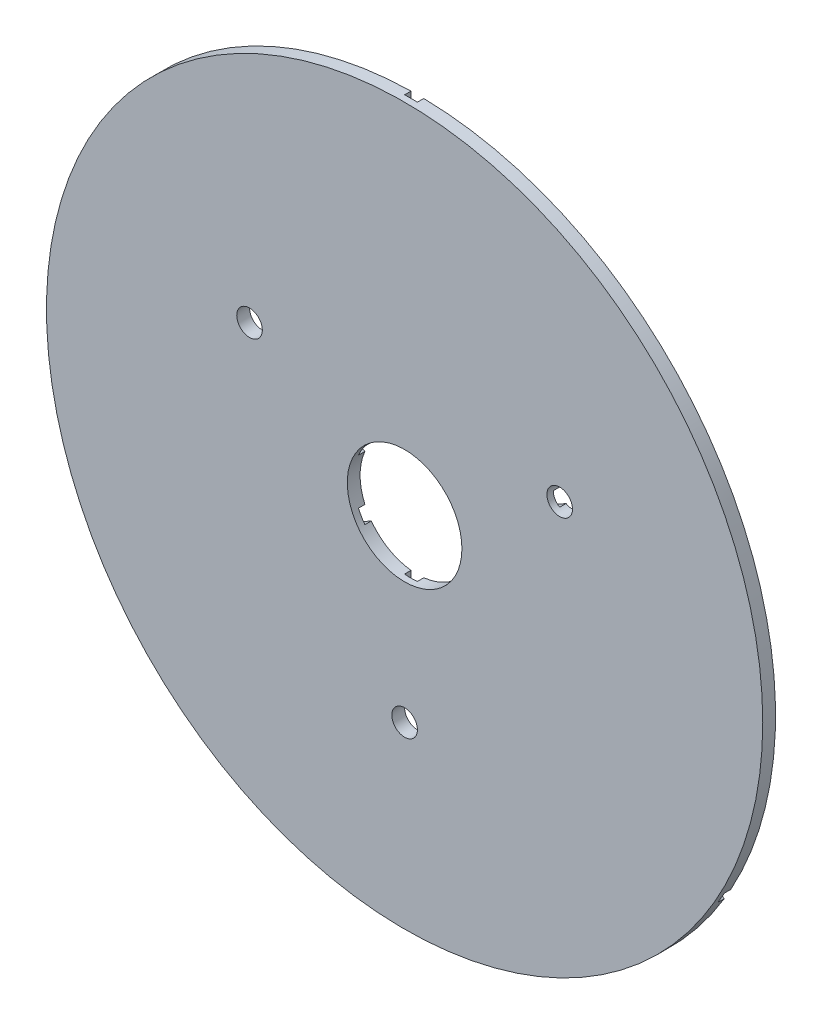
ISO-10303-21;
HEADER;
FILE_DESCRIPTION(('STEP AP214'),'2;1');
FILE_NAME('part.step','',(''),(''),'','','');
FILE_SCHEMA(('AUTOMOTIVE_DESIGN { 1 0 10303 214 1 1 1 1 }'));
ENDSEC;
DATA;
#1=APPLICATION_CONTEXT('core data for automotive mechanical design processes');
#2=APPLICATION_PROTOCOL_DEFINITION('international standard','automotive_design',2000,#1);
#3=PRODUCT_CONTEXT('',#1,'mechanical');
#4=PRODUCT('Part','Part','',(#3));
#5=PRODUCT_RELATED_PRODUCT_CATEGORY('part','',(#4));
#6=PRODUCT_DEFINITION_FORMATION('','',#4);
#7=PRODUCT_DEFINITION_CONTEXT('part definition',#1,'design');
#8=PRODUCT_DEFINITION('design','',#6,#7);
#9=PRODUCT_DEFINITION_SHAPE('','',#8);
#10=(LENGTH_UNIT() NAMED_UNIT(*) SI_UNIT(.MILLI.,.METRE.));
#11=(NAMED_UNIT(*) PLANE_ANGLE_UNIT() SI_UNIT($,.RADIAN.));
#12=(NAMED_UNIT(*) SI_UNIT($,.STERADIAN.) SOLID_ANGLE_UNIT());
#13=UNCERTAINTY_MEASURE_WITH_UNIT(LENGTH_MEASURE(1.E-05),#10,'distance_accuracy_value','');
#14=(GEOMETRIC_REPRESENTATION_CONTEXT(3) GLOBAL_UNCERTAINTY_ASSIGNED_CONTEXT((#13)) GLOBAL_UNIT_ASSIGNED_CONTEXT((#10,
#11,#12)) REPRESENTATION_CONTEXT('',''));
#15=CARTESIAN_POINT('',(0.,0.,0.));
#16=DIRECTION('',(0.,0.,1.));
#17=DIRECTION('',(1.,0.,0.));
#18=AXIS2_PLACEMENT_3D('',#15,#16,#17);
#19=CARTESIAN_POINT('',(0.,0.,1.5875));
#20=DIRECTION('',(0.,0.,-1.));
#21=DIRECTION('',(-1.,0.,0.));
#22=AXIS2_PLACEMENT_3D('',#19,#20,#21);
#23=PLANE('',#22);
#24=CARTESIAN_POINT('',(0.,0.,1.5875));
#25=DIRECTION('',(0.,0.,-1.));
#26=DIRECTION('',(-1.,0.,0.));
#27=AXIS2_PLACEMENT_3D('',#24,#25,#26);
#28=CIRCLE('',#27,14.224);
#29=CARTESIAN_POINT('',(-13.0351353306108,5.692751787375,1.5875));
#30=VERTEX_POINT('',#29);
#31=CARTESIAN_POINT('',(-11.4476353306107,8.44238244439053,1.5875));
#32=VERTEX_POINT('',#31);
#33=EDGE_CURVE('E11',#30,#32,#28,.T.);
#34=ORIENTED_EDGE('',*,*,#33,.F.);
#35=DIRECTION('',(-0.866025403784436,0.500000000000005,0.));
#36=VECTOR('',#35,1.);
#37=CARTESIAN_POINT('',(-0.793749999999747,-1.37481532850734,1.5875));
#38=LINE('',#37,#36);
#39=CARTESIAN_POINT('',(-36.9073291982175,19.4753693429848,1.5875));
#40=VERTEX_POINT('',#39);
#41=EDGE_CURVE('E139',#30,#40,#38,.T.);
#42=ORIENTED_EDGE('',*,*,#41,.T.);
#43=CARTESIAN_POINT('',(-38.4948291982183,22.225,1.5875));
#44=DIRECTION('',(0.,0.,-1.));
#45=DIRECTION('',(-1.,0.,0.));
#46=AXIS2_PLACEMENT_3D('',#43,#44,#45);
#47=CIRCLE('',#46,3.175);
#48=CARTESIAN_POINT('',(-35.3198291982183,22.2250000000009,1.5875));
#49=VERTEX_POINT('',#48);
#50=EDGE_CURVE('E57',#49,#40,#47,.T.);
#51=ORIENTED_EDGE('',*,*,#50,.F.);
#52=DIRECTION('',(-0.866025403784436,0.500000000000005,0.));
#53=VECTOR('',#52,1.);
#54=CARTESIAN_POINT('',(0.793750000000271,1.37481532850825,1.5875));
#55=LINE('',#54,#53);
#56=EDGE_CURVE('E178',#32,#49,#55,.T.);
#57=ORIENTED_EDGE('',*,*,#56,.F.);
#58=EDGE_LOOP('',(#34,#42,#51,#57));
#59=FACE_BOUND('',#58,.T.);
#60=ADVANCED_FACE('F32',(#59),#23,.T.);
#61=CARTESIAN_POINT('',(-1.5875,14.1351342317645,1.5875));
#62=VERTEX_POINT('',#61);
#63=CARTESIAN_POINT('',(1.5875,14.1351342317645,1.5875));
#64=VERTEX_POINT('',#63);
#65=EDGE_CURVE('E41',#62,#64,#28,.T.);
#66=ORIENTED_EDGE('',*,*,#65,.F.);
#67=DIRECTION('',(0.,1.,0.));
#68=VECTOR('',#67,1.);
#69=CARTESIAN_POINT('',(-1.5875,0.,1.5875));
#70=LINE('',#69,#68);
#71=CARTESIAN_POINT('',(-1.5875,88.8858247627258,1.5875));
#72=VERTEX_POINT('',#71);
#73=EDGE_CURVE('E94',#62,#72,#70,.T.);
#74=ORIENTED_EDGE('',*,*,#73,.T.);
#75=CARTESIAN_POINT('',(0.,0.,1.5875));
#76=DIRECTION('',(0.,0.,-1.));
#77=DIRECTION('',(-1.,0.,0.));
#78=AXIS2_PLACEMENT_3D('',#75,#76,#77);
#79=CIRCLE('',#78,88.9);
#80=CARTESIAN_POINT('',(1.5875,88.8858247627258,1.5875));
#81=VERTEX_POINT('',#80);
#82=EDGE_CURVE('E294',#72,#81,#79,.T.);
#83=ORIENTED_EDGE('',*,*,#82,.T.);
#84=DIRECTION('',(0.,1.,0.));
#85=VECTOR('',#84,1.);
#86=CARTESIAN_POINT('',(1.5875,0.,1.5875));
#87=LINE('',#86,#85);
#88=EDGE_CURVE('E299',#64,#81,#87,.T.);
#89=ORIENTED_EDGE('',*,*,#88,.F.);
#90=EDGE_LOOP('',(#66,#74,#83,#89));
#91=FACE_BOUND('',#90,.T.);
#92=ADVANCED_FACE('F447',(#91),#23,.T.);
#93=CARTESIAN_POINT('',(11.4476353306107,8.44238244439054,1.5875));
#94=VERTEX_POINT('',#93);
#95=CARTESIAN_POINT('',(13.0351353306108,5.69275178737501,1.5875));
#96=VERTEX_POINT('',#95);
#97=EDGE_CURVE('E477',#94,#96,#28,.T.);
#98=ORIENTED_EDGE('',*,*,#97,.F.);
#99=DIRECTION('',(0.866025403784436,0.500000000000005,0.));
#100=VECTOR('',#99,1.);
#101=CARTESIAN_POINT('',(-0.793750000000274,1.37481532850825,1.5875));
#102=LINE('',#101,#100);
#103=CARTESIAN_POINT('',(35.3198291982183,22.2250000000009,1.5875));
#104=VERTEX_POINT('',#103);
#105=EDGE_CURVE('E301',#94,#104,#102,.T.);
#106=ORIENTED_EDGE('',*,*,#105,.T.);
#107=CARTESIAN_POINT('',(38.4948291982183,22.225,1.5875));
#108=DIRECTION('',(0.,0.,-1.));
#109=DIRECTION('',(-1.,0.,0.));
#110=AXIS2_PLACEMENT_3D('',#107,#108,#109);
#111=CIRCLE('',#110,3.175);
#112=CARTESIAN_POINT('',(36.9073291982175,19.4753693429848,1.5875));
#113=VERTEX_POINT('',#112);
#114=EDGE_CURVE('E304',#113,#104,#111,.T.);
#115=ORIENTED_EDGE('',*,*,#114,.F.);
#116=DIRECTION('',(0.866025403784436,0.500000000000005,0.));
#117=VECTOR('',#116,1.);
#118=CARTESIAN_POINT('',(0.793749999999744,-1.37481532850733,1.5875));
#119=LINE('',#118,#117);
#120=EDGE_CURVE('E306',#96,#113,#119,.T.);
#121=ORIENTED_EDGE('',*,*,#120,.F.);
#122=EDGE_LOOP('',(#98,#106,#115,#121));
#123=FACE_BOUND('',#122,.T.);
#124=ADVANCED_FACE('F452',(#123),#23,.T.);
#125=CARTESIAN_POINT('',(13.0351353306113,-5.69275178737403,1.5875));
#126=VERTEX_POINT('',#125);
#127=CARTESIAN_POINT('',(11.4476353306113,-8.44238244438968,1.5875));
#128=VERTEX_POINT('',#127);
#129=EDGE_CURVE('E475',#126,#128,#28,.T.);
#130=ORIENTED_EDGE('',*,*,#129,.F.);
#131=DIRECTION('',(-0.866025403784436,0.500000000000005,0.));
#132=VECTOR('',#131,1.);
#133=CARTESIAN_POINT('',(0.793750000000271,1.37481532850825,1.5875));
#134=LINE('',#133,#132);
#135=CARTESIAN_POINT('',(77.7711322808525,-43.0680970528551,1.5875));
#136=VERTEX_POINT('',#135);
#137=EDGE_CURVE('E309',#136,#126,#134,.T.);
#138=ORIENTED_EDGE('',*,*,#137,.F.);
#139=CARTESIAN_POINT('',(0.,0.,1.5875));
#140=DIRECTION('',(0.,0.,-1.));
#141=DIRECTION('',(-1.,0.,0.));
#142=AXIS2_PLACEMENT_3D('',#139,#140,#141);
#143=CIRCLE('',#142,88.9);
#144=CARTESIAN_POINT('',(76.1836322808525,-45.8177277098707,1.5875));
#145=VERTEX_POINT('',#144);
#146=EDGE_CURVE('E312',#136,#145,#143,.T.);
#147=ORIENTED_EDGE('',*,*,#146,.T.);
#148=DIRECTION('',(-0.866025403784436,0.500000000000005,0.));
#149=VECTOR('',#148,1.);
#150=CARTESIAN_POINT('',(-0.793749999999747,-1.37481532850734,1.5875));
#151=LINE('',#150,#149);
#152=EDGE_CURVE('E315',#145,#128,#151,.T.);
#153=ORIENTED_EDGE('',*,*,#152,.T.);
#154=EDGE_LOOP('',(#130,#138,#147,#153));
#155=FACE_BOUND('',#154,.T.);
#156=ADVANCED_FACE('F461',(#155),#23,.T.);
#157=CARTESIAN_POINT('',(1.5875,-14.1351342317645,1.5875));
#158=VERTEX_POINT('',#157);
#159=CARTESIAN_POINT('',(-1.5875,-14.1351342317645,1.5875));
#160=VERTEX_POINT('',#159);
#161=EDGE_CURVE('E329',#158,#160,#28,.T.);
#162=ORIENTED_EDGE('',*,*,#161,.F.);
#163=DIRECTION('',(0.,1.,0.));
#164=VECTOR('',#163,1.);
#165=CARTESIAN_POINT('',(1.5875,0.,1.5875));
#166=LINE('',#165,#164);
#167=CARTESIAN_POINT('',(1.5875,-41.7003693429844,1.5875));
#168=VERTEX_POINT('',#167);
#169=EDGE_CURVE('E318',#168,#158,#166,.T.);
#170=ORIENTED_EDGE('',*,*,#169,.F.);
#171=CARTESIAN_POINT('',(0.,-44.45,1.5875));
#172=DIRECTION('',(0.,0.,-1.));
#173=DIRECTION('',(-1.,0.,0.));
#174=AXIS2_PLACEMENT_3D('',#171,#172,#173);
#175=CIRCLE('',#174,3.175);
#176=CARTESIAN_POINT('',(-1.5875,-41.7003693429844,1.5875));
#177=VERTEX_POINT('',#176);
#178=EDGE_CURVE('E321',#177,#168,#175,.T.);
#179=ORIENTED_EDGE('',*,*,#178,.F.);
#180=DIRECTION('',(0.,1.,0.));
#181=VECTOR('',#180,1.);
#182=CARTESIAN_POINT('',(-1.5875,0.,1.5875));
#183=LINE('',#182,#181);
#184=EDGE_CURVE('E133',#177,#160,#183,.T.);
#185=ORIENTED_EDGE('',*,*,#184,.T.);
#186=EDGE_LOOP('',(#162,#170,#179,#185));
#187=FACE_BOUND('',#186,.T.);
#188=ADVANCED_FACE('F327',(#187),#23,.T.);
#189=CARTESIAN_POINT('',(0.,0.,3.175));
#190=DIRECTION('',(0.,0.,-1.));
#191=DIRECTION('',(-1.,0.,0.));
#192=AXIS2_PLACEMENT_3D('',#189,#190,#191);
#193=CYLINDRICAL_SURFACE('',#192,88.9);
#194=CARTESIAN_POINT('',(0.,0.,3.175));
#195=DIRECTION('',(0.,0.,1.));
#196=DIRECTION('',(1.,0.,0.));
#197=AXIS2_PLACEMENT_3D('',#194,#195,#196);
#198=CIRCLE('',#197,88.9);
#199=CARTESIAN_POINT('',(88.9,0.,3.175));
#200=VERTEX_POINT('',#199);
#201=EDGE_CURVE('E207',#200,#200,#198,.T.);
#202=ORIENTED_EDGE('',*,*,#201,.F.);
#203=EDGE_LOOP('',(#202));
#204=FACE_BOUND('',#203,.T.);
#205=DIRECTION('',(0.,0.,-1.));
#206=VECTOR('',#205,1.);
#207=CARTESIAN_POINT('',(1.5875,88.8858247627258,1.5875));
#208=LINE('',#207,#206);
#209=CARTESIAN_POINT('',(1.5875,88.8858247627258,0.));
#210=VERTEX_POINT('',#209);
#211=EDGE_CURVE('E202',#81,#210,#208,.T.);
#212=ORIENTED_EDGE('',*,*,#211,.F.);
#213=ORIENTED_EDGE('',*,*,#82,.F.);
#214=DIRECTION('',(0.,0.,-1.));
#215=VECTOR('',#214,1.);
#216=CARTESIAN_POINT('',(-1.5875,88.8858247627258,1.5875));
#217=LINE('',#216,#215);
#218=CARTESIAN_POINT('',(-1.5875,88.8858247627258,0.));
#219=VERTEX_POINT('',#218);
#220=EDGE_CURVE('E145',#72,#219,#217,.T.);
#221=ORIENTED_EDGE('',*,*,#220,.T.);
#222=CARTESIAN_POINT('',(0.,0.,0.));
#223=DIRECTION('',(0.,0.,1.));
#224=DIRECTION('',(1.,0.,0.));
#225=AXIS2_PLACEMENT_3D('',#222,#223,#224);
#226=CIRCLE('',#225,88.9);
#227=CARTESIAN_POINT('',(-77.7711322808525,-43.0680970528551,0.));
#228=VERTEX_POINT('',#227);
#229=EDGE_CURVE('E209',#219,#228,#226,.T.);
#230=ORIENTED_EDGE('',*,*,#229,.T.);
#231=DIRECTION('',(0.,0.,-1.));
#232=VECTOR('',#231,1.);
#233=CARTESIAN_POINT('',(-77.7711322808525,-43.0680970528551,1.5875));
#234=LINE('',#233,#232);
#235=CARTESIAN_POINT('',(-77.7711322808525,-43.0680970528551,1.5875));
#236=VERTEX_POINT('',#235);
#237=EDGE_CURVE('E85',#236,#228,#234,.T.);
#238=ORIENTED_EDGE('',*,*,#237,.F.);
#239=CARTESIAN_POINT('',(0.,0.,1.5875));
#240=DIRECTION('',(0.,0.,-1.));
#241=DIRECTION('',(-1.,0.,0.));
#242=AXIS2_PLACEMENT_3D('',#239,#240,#241);
#243=CIRCLE('',#242,88.9);
#244=CARTESIAN_POINT('',(-76.1836322808525,-45.8177277098707,1.5875));
#245=VERTEX_POINT('',#244);
#246=EDGE_CURVE('E132',#245,#236,#243,.T.);
#247=ORIENTED_EDGE('',*,*,#246,.F.);
#248=DIRECTION('',(0.,0.,-1.));
#249=VECTOR('',#248,1.);
#250=CARTESIAN_POINT('',(-76.1836322808525,-45.8177277098707,1.5875));
#251=LINE('',#250,#249);
#252=CARTESIAN_POINT('',(-76.1836322808525,-45.8177277098707,0.));
#253=VERTEX_POINT('',#252);
#254=EDGE_CURVE('E116',#245,#253,#251,.T.);
#255=ORIENTED_EDGE('',*,*,#254,.T.);
#256=CARTESIAN_POINT('',(76.1836322808525,-45.8177277098707,0.));
#257=VERTEX_POINT('',#256);
#258=EDGE_CURVE('E211',#253,#257,#226,.T.);
#259=ORIENTED_EDGE('',*,*,#258,.T.);
#260=DIRECTION('',(0.,0.,-1.));
#261=VECTOR('',#260,1.);
#262=CARTESIAN_POINT('',(76.1836322808525,-45.8177277098707,1.5875));
#263=LINE('',#262,#261);
#264=EDGE_CURVE('E191',#145,#257,#263,.T.);
#265=ORIENTED_EDGE('',*,*,#264,.F.);
#266=ORIENTED_EDGE('',*,*,#146,.F.);
#267=DIRECTION('',(0.,0.,-1.));
#268=VECTOR('',#267,1.);
#269=CARTESIAN_POINT('',(77.7711322808525,-43.0680970528551,1.5875));
#270=LINE('',#269,#268);
#271=CARTESIAN_POINT('',(77.7711322808525,-43.0680970528551,0.));
#272=VERTEX_POINT('',#271);
#273=EDGE_CURVE('E193',#136,#272,#270,.T.);
#274=ORIENTED_EDGE('',*,*,#273,.T.);
#275=EDGE_CURVE('E182',#272,#210,#226,.T.);
#276=ORIENTED_EDGE('',*,*,#275,.T.);
#277=EDGE_LOOP('',(#212,#213,#221,#230,#238,#247,#255,#259,#265,#266,#274,#276));
#278=FACE_BOUND('',#277,.T.);
#279=ADVANCED_FACE('F34',(#204,#278),#193,.T.);
#280=CARTESIAN_POINT('',(0.,0.,0.));
#281=DIRECTION('',(0.,0.,1.));
#282=DIRECTION('',(1.,0.,0.));
#283=AXIS2_PLACEMENT_3D('',#280,#281,#282);
#284=PLANE('',#283);
#285=DIRECTION('',(0.,1.,0.));
#286=VECTOR('',#285,1.);
#287=CARTESIAN_POINT('',(-1.5875,0.,0.));
#288=LINE('',#287,#286);
#289=CARTESIAN_POINT('',(-1.5875,-41.7003693429844,0.));
#290=VERTEX_POINT('',#289);
#291=CARTESIAN_POINT('',(-1.5875,-14.1351342317645,0.));
#292=VERTEX_POINT('',#291);
#293=EDGE_CURVE('E169',#290,#292,#288,.T.);
#294=ORIENTED_EDGE('',*,*,#293,.F.);
#295=CARTESIAN_POINT('',(0.,-44.45,0.));
#296=DIRECTION('',(0.,0.,-1.));
#297=DIRECTION('',(-1.,0.,0.));
#298=AXIS2_PLACEMENT_3D('',#295,#296,#297);
#299=CIRCLE('',#298,3.175);
#300=CARTESIAN_POINT('',(1.5875,-41.7003693429844,0.));
#301=VERTEX_POINT('',#300);
#302=EDGE_CURVE('E386',#301,#290,#299,.T.);
#303=ORIENTED_EDGE('',*,*,#302,.F.);
#304=DIRECTION('',(0.,1.,0.));
#305=VECTOR('',#304,1.);
#306=CARTESIAN_POINT('',(1.5875,0.,0.));
#307=LINE('',#306,#305);
#308=CARTESIAN_POINT('',(1.5875,-14.1351342317645,0.));
#309=VERTEX_POINT('',#308);
#310=EDGE_CURVE('E166',#301,#309,#307,.T.);
#311=ORIENTED_EDGE('',*,*,#310,.T.);
#312=CARTESIAN_POINT('',(0.,0.,0.));
#313=DIRECTION('',(0.,0.,1.));
#314=DIRECTION('',(1.,0.,0.));
#315=AXIS2_PLACEMENT_3D('',#312,#313,#314);
#316=CIRCLE('',#315,14.224);
#317=CARTESIAN_POINT('',(11.4476353306113,-8.44238244438968,0.));
#318=VERTEX_POINT('',#317);
#319=EDGE_CURVE('E393',#309,#318,#316,.T.);
#320=ORIENTED_EDGE('',*,*,#319,.T.);
#321=DIRECTION('',(-0.866025403784436,0.500000000000005,0.));
#322=VECTOR('',#321,1.);
#323=CARTESIAN_POINT('',(-0.793749999999747,-1.37481532850734,0.));
#324=LINE('',#323,#322);
#325=EDGE_CURVE('E163',#257,#318,#324,.T.);
#326=ORIENTED_EDGE('',*,*,#325,.F.);
#327=ORIENTED_EDGE('',*,*,#258,.F.);
#328=DIRECTION('',(0.866025403784436,0.500000000000005,0.));
#329=VECTOR('',#328,1.);
#330=CARTESIAN_POINT('',(0.793749999999744,-1.37481532850733,0.));
#331=LINE('',#330,#329);
#332=CARTESIAN_POINT('',(-11.4476353306113,-8.44238244438967,0.));
#333=VERTEX_POINT('',#332);
#334=EDGE_CURVE('E121',#253,#333,#331,.T.);
#335=ORIENTED_EDGE('',*,*,#334,.T.);
#336=EDGE_CURVE('E503',#333,#292,#316,.T.);
#337=ORIENTED_EDGE('',*,*,#336,.T.);
#338=EDGE_LOOP('',(#294,#303,#311,#320,#326,#327,#335,#337));
#339=FACE_BOUND('',#338,.T.);
#340=ADVANCED_FACE('F466',(#339),#284,.F.);
#341=DIRECTION('',(0.866025403784436,0.500000000000005,0.));
#342=VECTOR('',#341,1.);
#343=CARTESIAN_POINT('',(0.793749999999744,-1.37481532850733,0.));
#344=LINE('',#343,#342);
#345=CARTESIAN_POINT('',(13.0351353306108,5.69275178737501,0.));
#346=VERTEX_POINT('',#345);
#347=CARTESIAN_POINT('',(36.9073291982175,19.4753693429848,0.));
#348=VERTEX_POINT('',#347);
#349=EDGE_CURVE('E157',#346,#348,#344,.T.);
#350=ORIENTED_EDGE('',*,*,#349,.T.);
#351=CARTESIAN_POINT('',(38.4948291982183,22.225,0.));
#352=DIRECTION('',(0.,0.,-1.));
#353=DIRECTION('',(-1.,0.,0.));
#354=AXIS2_PLACEMENT_3D('',#351,#352,#353);
#355=CIRCLE('',#354,3.175);
#356=CARTESIAN_POINT('',(35.3198291982183,22.225,0.));
#357=VERTEX_POINT('',#356);
#358=EDGE_CURVE('E383',#357,#348,#355,.T.);
#359=ORIENTED_EDGE('',*,*,#358,.F.);
#360=DIRECTION('',(0.866025403784436,0.500000000000005,0.));
#361=VECTOR('',#360,1.);
#362=CARTESIAN_POINT('',(-0.793750000000274,1.37481532850825,0.));
#363=LINE('',#362,#361);
#364=CARTESIAN_POINT('',(11.4476353306107,8.44238244439053,0.));
#365=VERTEX_POINT('',#364);
#366=EDGE_CURVE('E154',#365,#357,#363,.T.);
#367=ORIENTED_EDGE('',*,*,#366,.F.);
#368=CARTESIAN_POINT('',(1.5875,14.1351342317645,0.));
#369=VERTEX_POINT('',#368);
#370=EDGE_CURVE('E363',#365,#369,#316,.T.);
#371=ORIENTED_EDGE('',*,*,#370,.T.);
#372=DIRECTION('',(0.,1.,0.));
#373=VECTOR('',#372,1.);
#374=CARTESIAN_POINT('',(1.5875,0.,0.));
#375=LINE('',#374,#373);
#376=EDGE_CURVE('E152',#369,#210,#375,.T.);
#377=ORIENTED_EDGE('',*,*,#376,.T.);
#378=ORIENTED_EDGE('',*,*,#275,.F.);
#379=DIRECTION('',(-0.866025403784436,0.500000000000005,0.));
#380=VECTOR('',#379,1.);
#381=CARTESIAN_POINT('',(0.793750000000271,1.37481532850825,0.));
#382=LINE('',#381,#380);
#383=CARTESIAN_POINT('',(13.0351353306113,-5.69275178737403,0.));
#384=VERTEX_POINT('',#383);
#385=EDGE_CURVE('E160',#272,#384,#382,.T.);
#386=ORIENTED_EDGE('',*,*,#385,.T.);
#387=EDGE_CURVE('E390',#384,#346,#316,.T.);
#388=ORIENTED_EDGE('',*,*,#387,.T.);
#389=EDGE_LOOP('',(#350,#359,#367,#371,#377,#378,#386,#388));
#390=FACE_BOUND('',#389,.T.);
#391=ADVANCED_FACE('F418',(#390),#284,.F.);
#392=CARTESIAN_POINT('',(0.,0.,3.175));
#393=DIRECTION('',(0.,0.,1.));
#394=DIRECTION('',(1.,0.,0.));
#395=AXIS2_PLACEMENT_3D('',#392,#393,#394);
#396=PLANE('',#395);
#397=CARTESIAN_POINT('',(38.4948291982183,22.225,3.175));
#398=DIRECTION('',(0.,0.,-1.));
#399=DIRECTION('',(-1.,0.,0.));
#400=AXIS2_PLACEMENT_3D('',#397,#398,#399);
#401=CIRCLE('',#400,3.175);
#402=CARTESIAN_POINT('',(35.3198291982183,22.225,3.175));
#403=VERTEX_POINT('',#402);
#404=EDGE_CURVE('E397',#403,#403,#401,.T.);
#405=ORIENTED_EDGE('',*,*,#404,.T.);
#406=EDGE_LOOP('',(#405));
#407=FACE_BOUND('',#406,.T.);
#408=CARTESIAN_POINT('',(-38.4948291982183,22.225,3.175));
#409=DIRECTION('',(0.,0.,-1.));
#410=DIRECTION('',(-1.,0.,0.));
#411=AXIS2_PLACEMENT_3D('',#408,#409,#410);
#412=CIRCLE('',#411,3.175);
#413=CARTESIAN_POINT('',(-41.6698291982183,22.225,3.175));
#414=VERTEX_POINT('',#413);
#415=EDGE_CURVE('E379',#414,#414,#412,.T.);
#416=ORIENTED_EDGE('',*,*,#415,.T.);
#417=EDGE_LOOP('',(#416));
#418=FACE_BOUND('',#417,.T.);
#419=CARTESIAN_POINT('',(0.,-44.45,3.175));
#420=DIRECTION('',(0.,0.,-1.));
#421=DIRECTION('',(-1.,0.,0.));
#422=AXIS2_PLACEMENT_3D('',#419,#420,#421);
#423=CIRCLE('',#422,3.175);
#424=CARTESIAN_POINT('',(-3.175,-44.45,3.175));
#425=VERTEX_POINT('',#424);
#426=EDGE_CURVE('E380',#425,#425,#423,.T.);
#427=ORIENTED_EDGE('',*,*,#426,.T.);
#428=EDGE_LOOP('',(#427));
#429=FACE_BOUND('',#428,.T.);
#430=CARTESIAN_POINT('',(0.,0.,3.175));
#431=DIRECTION('',(0.,0.,1.));
#432=DIRECTION('',(1.,0.,0.));
#433=AXIS2_PLACEMENT_3D('',#430,#431,#432);
#434=CIRCLE('',#433,14.224);
#435=CARTESIAN_POINT('',(14.224,0.,3.175));
#436=VERTEX_POINT('',#435);
#437=EDGE_CURVE('E394',#436,#436,#434,.T.);
#438=ORIENTED_EDGE('',*,*,#437,.F.);
#439=EDGE_LOOP('',(#438));
#440=FACE_BOUND('',#439,.T.);
#441=ORIENTED_EDGE('',*,*,#201,.T.);
#442=EDGE_LOOP('',(#441));
#443=FACE_BOUND('',#442,.T.);
#444=ADVANCED_FACE('F430',(#407,#418,#429,#440,#443),#396,.T.);
#445=DIRECTION('',(-0.866025403784436,0.500000000000005,0.));
#446=VECTOR('',#445,1.);
#447=CARTESIAN_POINT('',(0.793750000000271,1.37481532850825,0.));
#448=LINE('',#447,#446);
#449=CARTESIAN_POINT('',(-11.4476353306107,8.44238244439053,0.));
#450=VERTEX_POINT('',#449);
#451=CARTESIAN_POINT('',(-35.3198291982183,22.2250000000009,0.));
#452=VERTEX_POINT('',#451);
#453=EDGE_CURVE('E146',#450,#452,#448,.T.);
#454=ORIENTED_EDGE('',*,*,#453,.T.);
#455=CARTESIAN_POINT('',(-38.4948291982183,22.225,0.));
#456=DIRECTION('',(0.,0.,-1.));
#457=DIRECTION('',(-1.,0.,0.));
#458=AXIS2_PLACEMENT_3D('',#455,#456,#457);
#459=CIRCLE('',#458,3.175);
#460=CARTESIAN_POINT('',(-36.9073291982175,19.4753693429848,0.));
#461=VERTEX_POINT('',#460);
#462=EDGE_CURVE('E378',#461,#452,#459,.T.);
#463=ORIENTED_EDGE('',*,*,#462,.F.);
#464=DIRECTION('',(-0.866025403784436,0.500000000000005,0.));
#465=VECTOR('',#464,1.);
#466=CARTESIAN_POINT('',(-0.793749999999747,-1.37481532850734,0.));
#467=LINE('',#466,#465);
#468=CARTESIAN_POINT('',(-13.0351353306108,5.692751787375,0.));
#469=VERTEX_POINT('',#468);
#470=EDGE_CURVE('E175',#469,#461,#467,.T.);
#471=ORIENTED_EDGE('',*,*,#470,.F.);
#472=CARTESIAN_POINT('',(-13.0351353306113,-5.69275178737403,0.));
#473=VERTEX_POINT('',#472);
#474=EDGE_CURVE('E224',#469,#473,#316,.T.);
#475=ORIENTED_EDGE('',*,*,#474,.T.);
#476=DIRECTION('',(0.866025403784436,0.500000000000005,0.));
#477=VECTOR('',#476,1.);
#478=CARTESIAN_POINT('',(-0.793750000000274,1.37481532850825,0.));
#479=LINE('',#478,#477);
#480=EDGE_CURVE('E173',#228,#473,#479,.T.);
#481=ORIENTED_EDGE('',*,*,#480,.F.);
#482=ORIENTED_EDGE('',*,*,#229,.F.);
#483=DIRECTION('',(0.,1.,0.));
#484=VECTOR('',#483,1.);
#485=CARTESIAN_POINT('',(-1.5875,0.,0.));
#486=LINE('',#485,#484);
#487=CARTESIAN_POINT('',(-1.5875,14.1351342317645,0.));
#488=VERTEX_POINT('',#487);
#489=EDGE_CURVE('E149',#488,#219,#486,.T.);
#490=ORIENTED_EDGE('',*,*,#489,.F.);
#491=EDGE_CURVE('E360',#488,#450,#316,.T.);
#492=ORIENTED_EDGE('',*,*,#491,.T.);
#493=EDGE_LOOP('',(#454,#463,#471,#475,#481,#482,#490,#492));
#494=FACE_BOUND('',#493,.T.);
#495=ADVANCED_FACE('F217',(#494),#284,.F.);
#496=CARTESIAN_POINT('',(0.793750000000271,1.37481532850825,1.5875));
#497=DIRECTION('',(-0.500000000000005,-0.866025403784436,0.));
#498=DIRECTION('',(0.866025403784436,-0.500000000000005,0.));
#499=AXIS2_PLACEMENT_3D('',#496,#497,#498);
#500=PLANE('',#499);
#501=DIRECTION('',(0.,0.,1.));
#502=VECTOR('',#501,1.);
#503=CARTESIAN_POINT('',(-11.4476353306107,8.44238244439053,0.));
#504=LINE('',#503,#502);
#505=EDGE_CURVE('E150',#32,#450,#504,.F.);
#506=ORIENTED_EDGE('',*,*,#505,.F.);
#507=ORIENTED_EDGE('',*,*,#56,.T.);
#508=DIRECTION('',(0.,0.,-1.));
#509=VECTOR('',#508,1.);
#510=CARTESIAN_POINT('',(-35.3198291982183,22.2250000000009,1.5875));
#511=LINE('',#510,#509);
#512=EDGE_CURVE('E179',#49,#452,#511,.T.);
#513=ORIENTED_EDGE('',*,*,#512,.T.);
#514=ORIENTED_EDGE('',*,*,#453,.F.);
#515=EDGE_LOOP('',(#506,#507,#513,#514));
#516=FACE_BOUND('',#515,.T.);
#517=ADVANCED_FACE('F290',(#516),#500,.T.);
#518=CARTESIAN_POINT('',(-0.793749999999747,-1.37481532850734,1.5875));
#519=DIRECTION('',(-0.500000000000005,-0.866025403784436,0.));
#520=DIRECTION('',(0.866025403784436,-0.500000000000005,0.));
#521=AXIS2_PLACEMENT_3D('',#518,#519,#520);
#522=PLANE('',#521);
#523=ORIENTED_EDGE('',*,*,#41,.F.);
#524=DIRECTION('',(0.,0.,1.));
#525=VECTOR('',#524,1.);
#526=CARTESIAN_POINT('',(-13.0351353306108,5.692751787375,0.));
#527=LINE('',#526,#525);
#528=EDGE_CURVE('E277',#30,#469,#527,.F.);
#529=ORIENTED_EDGE('',*,*,#528,.T.);
#530=ORIENTED_EDGE('',*,*,#470,.T.);
#531=DIRECTION('',(0.,0.,-1.));
#532=VECTOR('',#531,1.);
#533=CARTESIAN_POINT('',(-36.9073291982175,19.4753693429848,1.5875));
#534=LINE('',#533,#532);
#535=EDGE_CURVE('E183',#40,#461,#534,.T.);
#536=ORIENTED_EDGE('',*,*,#535,.F.);
#537=EDGE_LOOP('',(#523,#529,#530,#536));
#538=FACE_BOUND('',#537,.T.);
#539=ADVANCED_FACE('F375',(#538),#522,.F.);
#540=CARTESIAN_POINT('',(-0.793750000000274,1.37481532850825,1.5875));
#541=DIRECTION('',(-0.500000000000005,0.866025403784436,0.));
#542=DIRECTION('',(-0.866025403784436,-0.500000000000005,0.));
#543=AXIS2_PLACEMENT_3D('',#540,#541,#542);
#544=PLANE('',#543);
#545=ORIENTED_EDGE('',*,*,#480,.T.);
#546=DIRECTION('',(0.,0.,1.));
#547=VECTOR('',#546,1.);
#548=CARTESIAN_POINT('',(-13.0351353306113,-5.69275178737403,0.));
#549=LINE('',#548,#547);
#550=CARTESIAN_POINT('',(-13.0351353306113,-5.69275178737403,1.5875));
#551=VERTEX_POINT('',#550);
#552=EDGE_CURVE('E229',#473,#551,#549,.T.);
#553=ORIENTED_EDGE('',*,*,#552,.T.);
#554=DIRECTION('',(0.866025403784436,0.500000000000005,0.));
#555=VECTOR('',#554,1.);
#556=CARTESIAN_POINT('',(-0.793750000000274,1.37481532850825,1.5875));
#557=LINE('',#556,#555);
#558=EDGE_CURVE('E137',#236,#551,#557,.T.);
#559=ORIENTED_EDGE('',*,*,#558,.F.);
#560=ORIENTED_EDGE('',*,*,#237,.T.);
#561=EDGE_LOOP('',(#545,#553,#559,#560));
#562=FACE_BOUND('',#561,.T.);
#563=ADVANCED_FACE('F226',(#562),#544,.F.);
#564=CARTESIAN_POINT('',(0.793749999999744,-1.37481532850733,1.5875));
#565=DIRECTION('',(-0.500000000000005,0.866025403784436,0.));
#566=DIRECTION('',(-0.866025403784436,-0.500000000000005,0.));
#567=AXIS2_PLACEMENT_3D('',#564,#565,#566);
#568=PLANE('',#567);
#569=DIRECTION('',(0.,0.,1.));
#570=VECTOR('',#569,1.);
#571=CARTESIAN_POINT('',(-11.4476353306113,-8.44238244438967,0.));
#572=LINE('',#571,#570);
#573=CARTESIAN_POINT('',(-11.4476353306113,-8.44238244438968,1.5875));
#574=VERTEX_POINT('',#573);
#575=EDGE_CURVE('E48',#333,#574,#572,.T.);
#576=ORIENTED_EDGE('',*,*,#575,.F.);
#577=ORIENTED_EDGE('',*,*,#334,.F.);
#578=ORIENTED_EDGE('',*,*,#254,.F.);
#579=DIRECTION('',(0.866025403784436,0.500000000000005,0.));
#580=VECTOR('',#579,1.);
#581=CARTESIAN_POINT('',(0.793749999999744,-1.37481532850733,1.5875));
#582=LINE('',#581,#580);
#583=EDGE_CURVE('E119',#245,#574,#582,.T.);
#584=ORIENTED_EDGE('',*,*,#583,.T.);
#585=EDGE_LOOP('',(#576,#577,#578,#584));
#586=FACE_BOUND('',#585,.T.);
#587=ADVANCED_FACE('F118',(#586),#568,.T.);
#588=CARTESIAN_POINT('',(-1.5875,0.,1.5875));
#589=DIRECTION('',(-1.,0.,0.));
#590=DIRECTION('',(0.,0.,1.));
#591=AXIS2_PLACEMENT_3D('',#588,#589,#590);
#592=PLANE('',#591);
#593=ORIENTED_EDGE('',*,*,#293,.T.);
#594=DIRECTION('',(0.,0.,1.));
#595=VECTOR('',#594,1.);
#596=CARTESIAN_POINT('',(-1.5875,-14.1351342317645,0.));
#597=LINE('',#596,#595);
#598=EDGE_CURVE('E337',#292,#160,#597,.T.);
#599=ORIENTED_EDGE('',*,*,#598,.T.);
#600=ORIENTED_EDGE('',*,*,#184,.F.);
#601=DIRECTION('',(0.,0.,-1.));
#602=VECTOR('',#601,1.);
#603=CARTESIAN_POINT('',(-1.5875,-41.7003693429844,1.5875));
#604=LINE('',#603,#602);
#605=EDGE_CURVE('E126',#177,#290,#604,.T.);
#606=ORIENTED_EDGE('',*,*,#605,.T.);
#607=EDGE_LOOP('',(#593,#599,#600,#606));
#608=FACE_BOUND('',#607,.T.);
#609=ADVANCED_FACE('F333',(#608),#592,.F.);
#610=CARTESIAN_POINT('',(1.5875,0.,1.5875));
#611=DIRECTION('',(-1.,0.,0.));
#612=DIRECTION('',(0.,0.,1.));
#613=AXIS2_PLACEMENT_3D('',#610,#611,#612);
#614=PLANE('',#613);
#615=DIRECTION('',(0.,0.,1.));
#616=VECTOR('',#615,1.);
#617=CARTESIAN_POINT('',(1.5875,-14.1351342317645,0.));
#618=LINE('',#617,#616);
#619=EDGE_CURVE('E400',#309,#158,#618,.T.);
#620=ORIENTED_EDGE('',*,*,#619,.F.);
#621=ORIENTED_EDGE('',*,*,#310,.F.);
#622=DIRECTION('',(0.,0.,-1.));
#623=VECTOR('',#622,1.);
#624=CARTESIAN_POINT('',(1.5875,-41.7003693429844,1.5875));
#625=LINE('',#624,#623);
#626=EDGE_CURVE('E188',#168,#301,#625,.T.);
#627=ORIENTED_EDGE('',*,*,#626,.F.);
#628=ORIENTED_EDGE('',*,*,#169,.T.);
#629=EDGE_LOOP('',(#620,#621,#627,#628));
#630=FACE_BOUND('',#629,.T.);
#631=ADVANCED_FACE('F501',(#630),#614,.T.);
#632=CARTESIAN_POINT('',(-0.793749999999747,-1.37481532850734,1.5875));
#633=DIRECTION('',(-0.500000000000005,-0.866025403784436,0.));
#634=DIRECTION('',(0.866025403784436,-0.500000000000005,0.));
#635=AXIS2_PLACEMENT_3D('',#632,#633,#634);
#636=PLANE('',#635);
#637=ORIENTED_EDGE('',*,*,#325,.T.);
#638=DIRECTION('',(0.,0.,1.));
#639=VECTOR('',#638,1.);
#640=CARTESIAN_POINT('',(11.4476353306113,-8.44238244438968,0.));
#641=LINE('',#640,#639);
#642=EDGE_CURVE('E405',#318,#128,#641,.T.);
#643=ORIENTED_EDGE('',*,*,#642,.T.);
#644=ORIENTED_EDGE('',*,*,#152,.F.);
#645=ORIENTED_EDGE('',*,*,#264,.T.);
#646=EDGE_LOOP('',(#637,#643,#644,#645));
#647=FACE_BOUND('',#646,.T.);
#648=ADVANCED_FACE('F505',(#647),#636,.F.);
#649=CARTESIAN_POINT('',(0.793750000000271,1.37481532850825,1.5875));
#650=DIRECTION('',(-0.500000000000005,-0.866025403784436,0.));
#651=DIRECTION('',(0.866025403784436,-0.500000000000005,0.));
#652=AXIS2_PLACEMENT_3D('',#649,#650,#651);
#653=PLANE('',#652);
#654=DIRECTION('',(0.,0.,1.));
#655=VECTOR('',#654,1.);
#656=CARTESIAN_POINT('',(13.0351353306113,-5.69275178737403,0.));
#657=LINE('',#656,#655);
#658=EDGE_CURVE('E403',#384,#126,#657,.T.);
#659=ORIENTED_EDGE('',*,*,#658,.F.);
#660=ORIENTED_EDGE('',*,*,#385,.F.);
#661=ORIENTED_EDGE('',*,*,#273,.F.);
#662=ORIENTED_EDGE('',*,*,#137,.T.);
#663=EDGE_LOOP('',(#659,#660,#661,#662));
#664=FACE_BOUND('',#663,.T.);
#665=ADVANCED_FACE('F480',(#664),#653,.T.);
#666=CARTESIAN_POINT('',(0.793749999999744,-1.37481532850733,1.5875));
#667=DIRECTION('',(-0.500000000000005,0.866025403784436,0.));
#668=DIRECTION('',(-0.866025403784436,-0.500000000000005,0.));
#669=AXIS2_PLACEMENT_3D('',#666,#667,#668);
#670=PLANE('',#669);
#671=DIRECTION('',(0.,0.,1.));
#672=VECTOR('',#671,1.);
#673=CARTESIAN_POINT('',(13.0351353306108,5.69275178737501,0.));
#674=LINE('',#673,#672);
#675=EDGE_CURVE('E368',#96,#346,#674,.F.);
#676=ORIENTED_EDGE('',*,*,#675,.F.);
#677=ORIENTED_EDGE('',*,*,#120,.T.);
#678=DIRECTION('',(0.,0.,-1.));
#679=VECTOR('',#678,1.);
#680=CARTESIAN_POINT('',(36.9073291982175,19.4753693429848,1.5875));
#681=LINE('',#680,#679);
#682=EDGE_CURVE('E196',#113,#348,#681,.T.);
#683=ORIENTED_EDGE('',*,*,#682,.T.);
#684=ORIENTED_EDGE('',*,*,#349,.F.);
#685=EDGE_LOOP('',(#676,#677,#683,#684));
#686=FACE_BOUND('',#685,.T.);
#687=ADVANCED_FACE('F488',(#686),#670,.T.);
#688=CARTESIAN_POINT('',(-0.793750000000274,1.37481532850825,1.5875));
#689=DIRECTION('',(-0.500000000000005,0.866025403784436,0.));
#690=DIRECTION('',(-0.866025403784436,-0.500000000000005,0.));
#691=AXIS2_PLACEMENT_3D('',#688,#689,#690);
#692=PLANE('',#691);
#693=ORIENTED_EDGE('',*,*,#105,.F.);
#694=DIRECTION('',(0.,0.,1.));
#695=VECTOR('',#694,1.);
#696=CARTESIAN_POINT('',(11.4476353306107,8.44238244439053,0.));
#697=LINE('',#696,#695);
#698=EDGE_CURVE('E371',#94,#365,#697,.F.);
#699=ORIENTED_EDGE('',*,*,#698,.T.);
#700=ORIENTED_EDGE('',*,*,#366,.T.);
#701=DIRECTION('',(0.,0.,-1.));
#702=VECTOR('',#701,1.);
#703=CARTESIAN_POINT('',(35.3198291982183,22.2250000000009,1.5875));
#704=LINE('',#703,#702);
#705=EDGE_CURVE('E199',#104,#357,#704,.T.);
#706=ORIENTED_EDGE('',*,*,#705,.F.);
#707=EDGE_LOOP('',(#693,#699,#700,#706));
#708=FACE_BOUND('',#707,.T.);
#709=ADVANCED_FACE('F411',(#708),#692,.F.);
#710=CARTESIAN_POINT('',(1.5875,0.,1.5875));
#711=DIRECTION('',(-1.,0.,0.));
#712=DIRECTION('',(0.,0.,1.));
#713=AXIS2_PLACEMENT_3D('',#710,#711,#712);
#714=PLANE('',#713);
#715=DIRECTION('',(0.,0.,1.));
#716=VECTOR('',#715,1.);
#717=CARTESIAN_POINT('',(1.5875,14.1351342317645,0.));
#718=LINE('',#717,#716);
#719=EDGE_CURVE('E367',#64,#369,#718,.F.);
#720=ORIENTED_EDGE('',*,*,#719,.F.);
#721=ORIENTED_EDGE('',*,*,#88,.T.);
#722=ORIENTED_EDGE('',*,*,#211,.T.);
#723=ORIENTED_EDGE('',*,*,#376,.F.);
#724=EDGE_LOOP('',(#720,#721,#722,#723));
#725=FACE_BOUND('',#724,.T.);
#726=ADVANCED_FACE('F458',(#725),#714,.T.);
#727=CARTESIAN_POINT('',(-1.5875,0.,1.5875));
#728=DIRECTION('',(-1.,0.,0.));
#729=DIRECTION('',(0.,0.,1.));
#730=AXIS2_PLACEMENT_3D('',#727,#728,#729);
#731=PLANE('',#730);
#732=ORIENTED_EDGE('',*,*,#73,.F.);
#733=DIRECTION('',(0.,0.,1.));
#734=VECTOR('',#733,1.);
#735=CARTESIAN_POINT('',(-1.5875,14.1351342317645,0.));
#736=LINE('',#735,#734);
#737=EDGE_CURVE('E362',#62,#488,#736,.F.);
#738=ORIENTED_EDGE('',*,*,#737,.T.);
#739=ORIENTED_EDGE('',*,*,#489,.T.);
#740=ORIENTED_EDGE('',*,*,#220,.F.);
#741=EDGE_LOOP('',(#732,#738,#739,#740));
#742=FACE_BOUND('',#741,.T.);
#743=ADVANCED_FACE('F366',(#742),#731,.F.);
#744=EDGE_CURVE('E36',#574,#551,#28,.T.);
#745=ORIENTED_EDGE('',*,*,#744,.F.);
#746=ORIENTED_EDGE('',*,*,#583,.F.);
#747=ORIENTED_EDGE('',*,*,#246,.T.);
#748=ORIENTED_EDGE('',*,*,#558,.T.);
#749=EDGE_LOOP('',(#745,#746,#747,#748));
#750=FACE_BOUND('',#749,.T.);
#751=ADVANCED_FACE('F130',(#750),#23,.T.);
#752=CARTESIAN_POINT('',(0.,0.,0.));
#753=DIRECTION('',(0.,0.,1.));
#754=DIRECTION('',(1.,0.,0.));
#755=AXIS2_PLACEMENT_3D('',#752,#753,#754);
#756=CYLINDRICAL_SURFACE('',#755,14.224);
#757=ORIENTED_EDGE('',*,*,#505,.T.);
#758=ORIENTED_EDGE('',*,*,#491,.F.);
#759=ORIENTED_EDGE('',*,*,#737,.F.);
#760=ORIENTED_EDGE('',*,*,#65,.T.);
#761=ORIENTED_EDGE('',*,*,#719,.T.);
#762=ORIENTED_EDGE('',*,*,#370,.F.);
#763=ORIENTED_EDGE('',*,*,#698,.F.);
#764=ORIENTED_EDGE('',*,*,#97,.T.);
#765=ORIENTED_EDGE('',*,*,#675,.T.);
#766=ORIENTED_EDGE('',*,*,#387,.F.);
#767=ORIENTED_EDGE('',*,*,#658,.T.);
#768=ORIENTED_EDGE('',*,*,#129,.T.);
#769=ORIENTED_EDGE('',*,*,#642,.F.);
#770=ORIENTED_EDGE('',*,*,#319,.F.);
#771=ORIENTED_EDGE('',*,*,#619,.T.);
#772=ORIENTED_EDGE('',*,*,#161,.T.);
#773=ORIENTED_EDGE('',*,*,#598,.F.);
#774=ORIENTED_EDGE('',*,*,#336,.F.);
#775=ORIENTED_EDGE('',*,*,#575,.T.);
#776=ORIENTED_EDGE('',*,*,#744,.T.);
#777=ORIENTED_EDGE('',*,*,#552,.F.);
#778=ORIENTED_EDGE('',*,*,#474,.F.);
#779=ORIENTED_EDGE('',*,*,#528,.F.);
#780=ORIENTED_EDGE('',*,*,#33,.T.);
#781=EDGE_LOOP('',(#757,#758,#759,#760,#761,#762,#763,#764,#765,#766,#767,#768,#769,#770,#771,
#772,#773,#774,#775,#776,#777,#778,#779,#780));
#782=FACE_BOUND('',#781,.T.);
#783=ORIENTED_EDGE('',*,*,#437,.T.);
#784=EDGE_LOOP('',(#783));
#785=FACE_BOUND('',#784,.T.);
#786=ADVANCED_FACE('F281',(#782,#785),#756,.F.);
#787=CARTESIAN_POINT('',(38.4948291982183,22.225,3.175));
#788=DIRECTION('',(0.,0.,-1.));
#789=DIRECTION('',(-1.,0.,0.));
#790=AXIS2_PLACEMENT_3D('',#787,#788,#789);
#791=CYLINDRICAL_SURFACE('',#790,3.175);
#792=ORIENTED_EDGE('',*,*,#682,.F.);
#793=ORIENTED_EDGE('',*,*,#114,.T.);
#794=ORIENTED_EDGE('',*,*,#705,.T.);
#795=ORIENTED_EDGE('',*,*,#358,.T.);
#796=EDGE_LOOP('',(#792,#793,#794,#795));
#797=FACE_BOUND('',#796,.T.);
#798=ORIENTED_EDGE('',*,*,#404,.F.);
#799=EDGE_LOOP('',(#798));
#800=FACE_BOUND('',#799,.T.);
#801=ADVANCED_FACE('F433',(#797,#800),#791,.F.);
#802=CARTESIAN_POINT('',(0.,-44.45,3.175));
#803=DIRECTION('',(0.,0.,-1.));
#804=DIRECTION('',(-1.,0.,0.));
#805=AXIS2_PLACEMENT_3D('',#802,#803,#804);
#806=CYLINDRICAL_SURFACE('',#805,3.175);
#807=ORIENTED_EDGE('',*,*,#426,.F.);
#808=EDGE_LOOP('',(#807));
#809=FACE_BOUND('',#808,.T.);
#810=ORIENTED_EDGE('',*,*,#178,.T.);
#811=ORIENTED_EDGE('',*,*,#626,.T.);
#812=ORIENTED_EDGE('',*,*,#302,.T.);
#813=ORIENTED_EDGE('',*,*,#605,.F.);
#814=EDGE_LOOP('',(#810,#811,#812,#813));
#815=FACE_BOUND('',#814,.T.);
#816=ADVANCED_FACE('F435',(#809,#815),#806,.F.);
#817=CARTESIAN_POINT('',(-38.4948291982183,22.225,3.175));
#818=DIRECTION('',(0.,0.,-1.));
#819=DIRECTION('',(-1.,0.,0.));
#820=AXIS2_PLACEMENT_3D('',#817,#818,#819);
#821=CYLINDRICAL_SURFACE('',#820,3.175);
#822=ORIENTED_EDGE('',*,*,#512,.F.);
#823=ORIENTED_EDGE('',*,*,#50,.T.);
#824=ORIENTED_EDGE('',*,*,#535,.T.);
#825=ORIENTED_EDGE('',*,*,#462,.T.);
#826=EDGE_LOOP('',(#822,#823,#824,#825));
#827=FACE_BOUND('',#826,.T.);
#828=ORIENTED_EDGE('',*,*,#415,.F.);
#829=EDGE_LOOP('',(#828));
#830=FACE_BOUND('',#829,.T.);
#831=ADVANCED_FACE('F441',(#827,#830),#821,.F.);
#832=CLOSED_SHELL('',(#60,#92,#124,#156,#188,#279,#340,#391,#444,#495,#517,#539,#563,#587,#609,
#631,#648,#665,#687,#709,#726,#743,#751,#786,#801,#816,#831));
#833=MANIFOLD_SOLID_BREP('B2',#832);
#834=ADVANCED_BREP_SHAPE_REPRESENTATION('',(#18,#833),#14);
#835=SHAPE_DEFINITION_REPRESENTATION(#9,#834);
ENDSEC;
END-ISO-10303-21;
